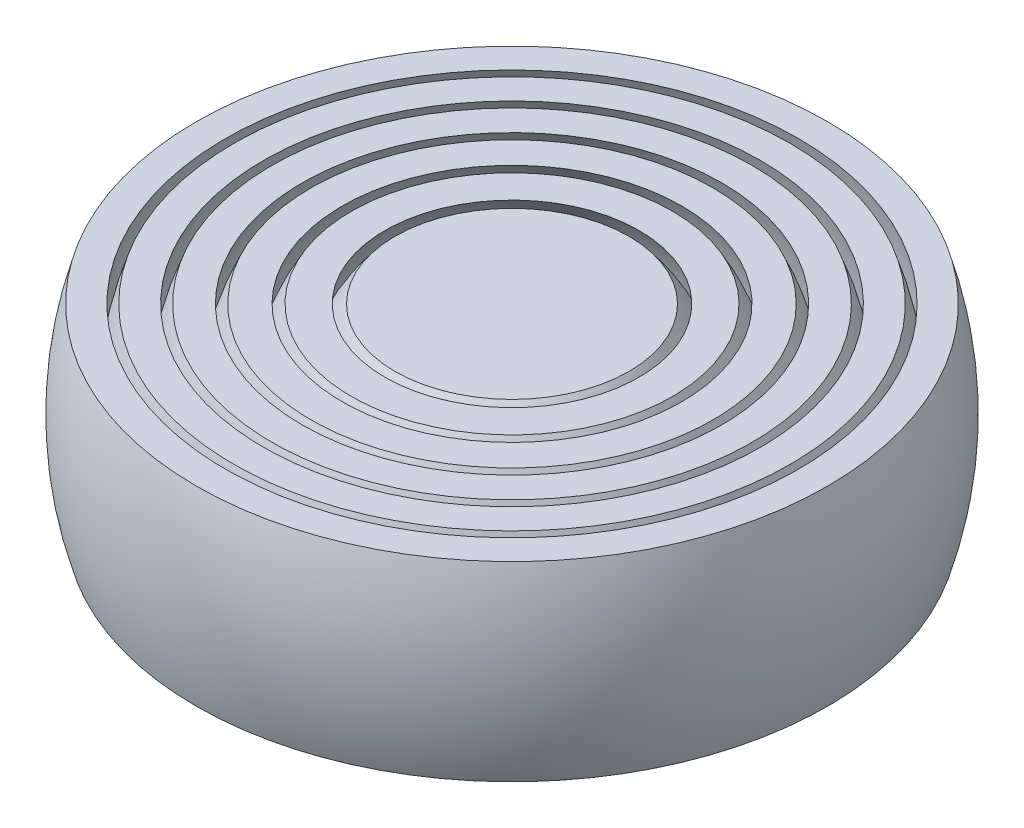
ISO-10303-21;
HEADER;
FILE_DESCRIPTION(('STEP AP214'),'2;1');
FILE_NAME('part.step','',(''),(''),'','','');
FILE_SCHEMA(('AUTOMOTIVE_DESIGN { 1 0 10303 214 1 1 1 1 }'));
ENDSEC;
DATA;
#1=APPLICATION_CONTEXT('core data for automotive mechanical design processes');
#2=APPLICATION_PROTOCOL_DEFINITION('international standard','automotive_design',2000,#1);
#3=PRODUCT_CONTEXT('',#1,'mechanical');
#4=PRODUCT('Part','Part','',(#3));
#5=PRODUCT_RELATED_PRODUCT_CATEGORY('part','',(#4));
#6=PRODUCT_DEFINITION_FORMATION('','',#4);
#7=PRODUCT_DEFINITION_CONTEXT('part definition',#1,'design');
#8=PRODUCT_DEFINITION('design','',#6,#7);
#9=PRODUCT_DEFINITION_SHAPE('','',#8);
#10=(LENGTH_UNIT() NAMED_UNIT(*) SI_UNIT(.MILLI.,.METRE.));
#11=(NAMED_UNIT(*) PLANE_ANGLE_UNIT() SI_UNIT($,.RADIAN.));
#12=(NAMED_UNIT(*) SI_UNIT($,.STERADIAN.) SOLID_ANGLE_UNIT());
#13=UNCERTAINTY_MEASURE_WITH_UNIT(LENGTH_MEASURE(1.E-05),#10,'distance_accuracy_value','');
#14=(GEOMETRIC_REPRESENTATION_CONTEXT(3) GLOBAL_UNCERTAINTY_ASSIGNED_CONTEXT((#13)) GLOBAL_UNIT_ASSIGNED_CONTEXT((#10,
#11,#12)) REPRESENTATION_CONTEXT('',''));
#15=CARTESIAN_POINT('',(0.,0.,0.));
#16=DIRECTION('',(0.,0.,1.));
#17=DIRECTION('',(1.,0.,0.));
#18=AXIS2_PLACEMENT_3D('',#15,#16,#17);
#19=CARTESIAN_POINT('',(0.,0.,0.));
#20=DIRECTION('',(0.,1.,0.));
#21=DIRECTION('',(1.,0.,0.));
#22=AXIS2_PLACEMENT_3D('',#19,#20,#21);
#23=SPHERICAL_SURFACE('',#22,19.);
#24=CARTESIAN_POINT('',(0.,6.,0.));
#25=DIRECTION('',(0.,-1.,0.));
#26=DIRECTION('',(0.,0.,-1.));
#27=AXIS2_PLACEMENT_3D('',#24,#25,#26);
#28=CIRCLE('',#27,18.0277563773199);
#29=CARTESIAN_POINT('',(0.,6.,-18.0277563773199));
#30=VERTEX_POINT('',#29);
#31=EDGE_CURVE('E46',#30,#30,#28,.F.);
#32=ORIENTED_EDGE('',*,*,#31,.T.);
#33=EDGE_LOOP('',(#32));
#34=FACE_BOUND('',#33,.T.);
#35=CARTESIAN_POINT('',(0.,-6.,0.));
#36=DIRECTION('',(0.,1.,0.));
#37=DIRECTION('',(0.,0.,1.));
#38=AXIS2_PLACEMENT_3D('',#35,#36,#37);
#39=CIRCLE('',#38,18.0277563773199);
#40=CARTESIAN_POINT('',(0.,-6.,18.0277563773199));
#41=VERTEX_POINT('',#40);
#42=EDGE_CURVE('E56',#41,#41,#39,.F.);
#43=ORIENTED_EDGE('',*,*,#42,.T.);
#44=EDGE_LOOP('',(#43));
#45=FACE_BOUND('',#44,.T.);
#46=ADVANCED_FACE('F42',(#34,#45),#23,.F.);
#47=CARTESIAN_POINT('',(-37.440696528812,-6.,-20.75));
#48=DIRECTION('',(0.,1.,0.));
#49=DIRECTION('',(0.,0.,1.));
#50=AXIS2_PLACEMENT_3D('',#47,#48,#49);
#51=PLANE('',#50);
#52=CARTESIAN_POINT('',(0.,-6.,0.));
#53=DIRECTION('',(0.,1.,0.));
#54=DIRECTION('',(0.,0.,1.));
#55=AXIS2_PLACEMENT_3D('',#52,#53,#54);
#56=CIRCLE('',#55,19.8635973579813);
#57=CARTESIAN_POINT('',(0.,-6.,19.8635973579813));
#58=VERTEX_POINT('',#57);
#59=EDGE_CURVE('E54',#58,#58,#56,.F.);
#60=ORIENTED_EDGE('',*,*,#59,.T.);
#61=EDGE_LOOP('',(#60));
#62=FACE_BOUND('',#61,.T.);
#63=ORIENTED_EDGE('',*,*,#42,.F.);
#64=EDGE_LOOP('',(#63));
#65=FACE_BOUND('',#64,.T.);
#66=ADVANCED_FACE('F63',(#62,#65),#51,.F.);
#67=CARTESIAN_POINT('',(-37.440696528812,6.,-20.75));
#68=DIRECTION('',(0.,-1.,0.));
#69=DIRECTION('',(0.,0.,-1.));
#70=AXIS2_PLACEMENT_3D('',#67,#68,#69);
#71=PLANE('',#70);
#72=CARTESIAN_POINT('',(0.,6.,0.));
#73=DIRECTION('',(0.,-1.,0.));
#74=DIRECTION('',(0.,0.,-1.));
#75=AXIS2_PLACEMENT_3D('',#72,#73,#74);
#76=CIRCLE('',#75,19.8635973579813);
#77=CARTESIAN_POINT('',(0.,6.,-19.8635973579813));
#78=VERTEX_POINT('',#77);
#79=EDGE_CURVE('E11',#78,#78,#76,.F.);
#80=ORIENTED_EDGE('',*,*,#79,.T.);
#81=EDGE_LOOP('',(#80));
#82=FACE_BOUND('',#81,.T.);
#83=ORIENTED_EDGE('',*,*,#31,.F.);
#84=EDGE_LOOP('',(#83));
#85=FACE_BOUND('',#84,.T.);
#86=ADVANCED_FACE('F67',(#82,#85),#71,.F.);
#87=CARTESIAN_POINT('',(0.,0.,0.));
#88=DIRECTION('',(0.,1.,0.));
#89=DIRECTION('',(-1.,0.,0.));
#90=AXIS2_PLACEMENT_3D('',#87,#88,#89);
#91=SPHERICAL_SURFACE('',#90,20.75);
#92=ORIENTED_EDGE('',*,*,#79,.F.);
#93=EDGE_LOOP('',(#92));
#94=FACE_BOUND('',#93,.T.);
#95=ORIENTED_EDGE('',*,*,#59,.F.);
#96=EDGE_LOOP('',(#95));
#97=FACE_BOUND('',#96,.T.);
#98=ADVANCED_FACE('F44',(#94,#97),#91,.T.);
#99=CLOSED_SHELL('',(#46,#66,#86,#98));
#100=MANIFOLD_SOLID_BREP('B2',#99);
#101=CARTESIAN_POINT('',(0.,0.,0.));
#102=DIRECTION('',(0.,1.,0.));
#103=DIRECTION('',(1.,0.,0.));
#104=AXIS2_PLACEMENT_3D('',#101,#102,#103);
#105=SPHERICAL_SURFACE('',#104,16.75);
#106=CARTESIAN_POINT('',(0.,6.,0.));
#107=DIRECTION('',(0.,-1.,0.));
#108=DIRECTION('',(0.,0.,-1.));
#109=AXIS2_PLACEMENT_3D('',#106,#107,#108);
#110=CIRCLE('',#109,15.6384941730334);
#111=CARTESIAN_POINT('',(0.,6.,-15.6384941730334));
#112=VERTEX_POINT('',#111);
#113=EDGE_CURVE('E116',#112,#112,#110,.F.);
#114=ORIENTED_EDGE('',*,*,#113,.T.);
#115=EDGE_LOOP('',(#114));
#116=FACE_BOUND('',#115,.T.);
#117=CARTESIAN_POINT('',(0.,-6.,0.));
#118=DIRECTION('',(0.,1.,0.));
#119=DIRECTION('',(0.,0.,1.));
#120=AXIS2_PLACEMENT_3D('',#117,#118,#119);
#121=CIRCLE('',#120,15.6384941730334);
#122=CARTESIAN_POINT('',(0.,-6.,15.6384941730334));
#123=VERTEX_POINT('',#122);
#124=EDGE_CURVE('E126',#123,#123,#121,.F.);
#125=ORIENTED_EDGE('',*,*,#124,.T.);
#126=EDGE_LOOP('',(#125));
#127=FACE_BOUND('',#126,.T.);
#128=ADVANCED_FACE('F112',(#116,#127),#105,.F.);
#129=CARTESIAN_POINT('',(-37.440696528812,-6.,-20.75));
#130=DIRECTION('',(0.,1.,0.));
#131=DIRECTION('',(0.,0.,1.));
#132=AXIS2_PLACEMENT_3D('',#129,#130,#131);
#133=PLANE('',#132);
#134=CARTESIAN_POINT('',(0.,-6.,0.));
#135=DIRECTION('',(0.,1.,0.));
#136=DIRECTION('',(0.,0.,1.));
#137=AXIS2_PLACEMENT_3D('',#134,#135,#136);
#138=CIRCLE('',#137,17.5);
#139=CARTESIAN_POINT('',(0.,-6.,17.5));
#140=VERTEX_POINT('',#139);
#141=EDGE_CURVE('E124',#140,#140,#138,.F.);
#142=ORIENTED_EDGE('',*,*,#141,.T.);
#143=EDGE_LOOP('',(#142));
#144=FACE_BOUND('',#143,.T.);
#145=ORIENTED_EDGE('',*,*,#124,.F.);
#146=EDGE_LOOP('',(#145));
#147=FACE_BOUND('',#146,.T.);
#148=ADVANCED_FACE('F133',(#144,#147),#133,.F.);
#149=CARTESIAN_POINT('',(-37.440696528812,6.,-20.75));
#150=DIRECTION('',(0.,-1.,0.));
#151=DIRECTION('',(0.,0.,-1.));
#152=AXIS2_PLACEMENT_3D('',#149,#150,#151);
#153=PLANE('',#152);
#154=CARTESIAN_POINT('',(0.,6.,0.));
#155=DIRECTION('',(0.,-1.,0.));
#156=DIRECTION('',(0.,0.,-1.));
#157=AXIS2_PLACEMENT_3D('',#154,#155,#156);
#158=CIRCLE('',#157,17.5);
#159=CARTESIAN_POINT('',(0.,6.,-17.5));
#160=VERTEX_POINT('',#159);
#161=EDGE_CURVE('E41',#160,#160,#158,.F.);
#162=ORIENTED_EDGE('',*,*,#161,.T.);
#163=EDGE_LOOP('',(#162));
#164=FACE_BOUND('',#163,.T.);
#165=ORIENTED_EDGE('',*,*,#113,.F.);
#166=EDGE_LOOP('',(#165));
#167=FACE_BOUND('',#166,.T.);
#168=ADVANCED_FACE('F137',(#164,#167),#153,.F.);
#169=CARTESIAN_POINT('',(0.,0.,0.));
#170=DIRECTION('',(0.,1.,0.));
#171=DIRECTION('',(1.,0.,0.));
#172=AXIS2_PLACEMENT_3D('',#169,#170,#171);
#173=SPHERICAL_SURFACE('',#172,18.5);
#174=ORIENTED_EDGE('',*,*,#161,.F.);
#175=EDGE_LOOP('',(#174));
#176=FACE_BOUND('',#175,.T.);
#177=ORIENTED_EDGE('',*,*,#141,.F.);
#178=EDGE_LOOP('',(#177));
#179=FACE_BOUND('',#178,.T.);
#180=ADVANCED_FACE('F114',(#176,#179),#173,.T.);
#181=CLOSED_SHELL('',(#128,#148,#168,#180));
#182=MANIFOLD_SOLID_BREP('B6',#181);
#183=CARTESIAN_POINT('',(0.,0.,0.));
#184=DIRECTION('',(0.,1.,0.));
#185=DIRECTION('',(1.,0.,0.));
#186=AXIS2_PLACEMENT_3D('',#183,#184,#185);
#187=SPHERICAL_SURFACE('',#186,14.5);
#188=CARTESIAN_POINT('',(0.,6.,0.));
#189=DIRECTION('',(0.,-1.,0.));
#190=DIRECTION('',(0.,0.,-1.));
#191=AXIS2_PLACEMENT_3D('',#188,#189,#190);
#192=CIRCLE('',#191,13.2003787824441);
#193=CARTESIAN_POINT('',(0.,6.,-13.2003787824441));
#194=VERTEX_POINT('',#193);
#195=EDGE_CURVE('E186',#194,#194,#192,.F.);
#196=ORIENTED_EDGE('',*,*,#195,.T.);
#197=EDGE_LOOP('',(#196));
#198=FACE_BOUND('',#197,.T.);
#199=CARTESIAN_POINT('',(0.,-6.,0.));
#200=DIRECTION('',(0.,1.,0.));
#201=DIRECTION('',(0.,0.,1.));
#202=AXIS2_PLACEMENT_3D('',#199,#200,#201);
#203=CIRCLE('',#202,13.2003787824441);
#204=CARTESIAN_POINT('',(0.,-6.,13.2003787824441));
#205=VERTEX_POINT('',#204);
#206=EDGE_CURVE('E196',#205,#205,#203,.F.);
#207=ORIENTED_EDGE('',*,*,#206,.T.);
#208=EDGE_LOOP('',(#207));
#209=FACE_BOUND('',#208,.T.);
#210=ADVANCED_FACE('F182',(#198,#209),#187,.F.);
#211=CARTESIAN_POINT('',(-37.440696528812,-6.,-20.75));
#212=DIRECTION('',(0.,1.,0.));
#213=DIRECTION('',(0.,0.,1.));
#214=AXIS2_PLACEMENT_3D('',#211,#212,#213);
#215=PLANE('',#214);
#216=CARTESIAN_POINT('',(0.,-6.,0.));
#217=DIRECTION('',(0.,1.,0.));
#218=DIRECTION('',(0.,0.,1.));
#219=AXIS2_PLACEMENT_3D('',#216,#217,#218);
#220=CIRCLE('',#219,15.101738310539);
#221=CARTESIAN_POINT('',(0.,-6.,15.101738310539));
#222=VERTEX_POINT('',#221);
#223=EDGE_CURVE('E194',#222,#222,#220,.F.);
#224=ORIENTED_EDGE('',*,*,#223,.T.);
#225=EDGE_LOOP('',(#224));
#226=FACE_BOUND('',#225,.T.);
#227=ORIENTED_EDGE('',*,*,#206,.F.);
#228=EDGE_LOOP('',(#227));
#229=FACE_BOUND('',#228,.T.);
#230=ADVANCED_FACE('F203',(#226,#229),#215,.F.);
#231=CARTESIAN_POINT('',(-37.440696528812,6.,-20.75));
#232=DIRECTION('',(0.,-1.,0.));
#233=DIRECTION('',(0.,0.,-1.));
#234=AXIS2_PLACEMENT_3D('',#231,#232,#233);
#235=PLANE('',#234);
#236=CARTESIAN_POINT('',(0.,6.,0.));
#237=DIRECTION('',(0.,-1.,0.));
#238=DIRECTION('',(0.,0.,-1.));
#239=AXIS2_PLACEMENT_3D('',#236,#237,#238);
#240=CIRCLE('',#239,15.101738310539);
#241=CARTESIAN_POINT('',(0.,6.,-15.101738310539));
#242=VERTEX_POINT('',#241);
#243=EDGE_CURVE('E111',#242,#242,#240,.F.);
#244=ORIENTED_EDGE('',*,*,#243,.T.);
#245=EDGE_LOOP('',(#244));
#246=FACE_BOUND('',#245,.T.);
#247=ORIENTED_EDGE('',*,*,#195,.F.);
#248=EDGE_LOOP('',(#247));
#249=FACE_BOUND('',#248,.T.);
#250=ADVANCED_FACE('F207',(#246,#249),#235,.F.);
#251=CARTESIAN_POINT('',(0.,0.,0.));
#252=DIRECTION('',(0.,1.,0.));
#253=DIRECTION('',(1.,0.,0.));
#254=AXIS2_PLACEMENT_3D('',#251,#252,#253);
#255=SPHERICAL_SURFACE('',#254,16.25);
#256=ORIENTED_EDGE('',*,*,#243,.F.);
#257=EDGE_LOOP('',(#256));
#258=FACE_BOUND('',#257,.T.);
#259=ORIENTED_EDGE('',*,*,#223,.F.);
#260=EDGE_LOOP('',(#259));
#261=FACE_BOUND('',#260,.T.);
#262=ADVANCED_FACE('F184',(#258,#261),#255,.T.);
#263=CLOSED_SHELL('',(#210,#230,#250,#262));
#264=MANIFOLD_SOLID_BREP('B36',#263);
#265=CARTESIAN_POINT('',(0.,0.,0.));
#266=DIRECTION('',(0.,1.,0.));
#267=DIRECTION('',(1.,0.,0.));
#268=AXIS2_PLACEMENT_3D('',#265,#266,#267);
#269=SPHERICAL_SURFACE('',#268,12.25);
#270=CARTESIAN_POINT('',(0.,6.,0.));
#271=DIRECTION('',(0.,-1.,0.));
#272=DIRECTION('',(0.,0.,-1.));
#273=AXIS2_PLACEMENT_3D('',#270,#271,#272);
#274=CIRCLE('',#273,10.6800046816469);
#275=CARTESIAN_POINT('',(0.,6.,-10.6800046816469));
#276=VERTEX_POINT('',#275);
#277=EDGE_CURVE('E256',#276,#276,#274,.F.);
#278=ORIENTED_EDGE('',*,*,#277,.T.);
#279=EDGE_LOOP('',(#278));
#280=FACE_BOUND('',#279,.T.);
#281=CARTESIAN_POINT('',(0.,-6.,0.));
#282=DIRECTION('',(0.,1.,0.));
#283=DIRECTION('',(0.,0.,1.));
#284=AXIS2_PLACEMENT_3D('',#281,#282,#283);
#285=CIRCLE('',#284,10.6800046816469);
#286=CARTESIAN_POINT('',(0.,-6.,10.6800046816469));
#287=VERTEX_POINT('',#286);
#288=EDGE_CURVE('E266',#287,#287,#285,.F.);
#289=ORIENTED_EDGE('',*,*,#288,.T.);
#290=EDGE_LOOP('',(#289));
#291=FACE_BOUND('',#290,.T.);
#292=ADVANCED_FACE('F252',(#280,#291),#269,.F.);
#293=CARTESIAN_POINT('',(-37.440696528812,-6.,-20.75));
#294=DIRECTION('',(0.,1.,0.));
#295=DIRECTION('',(0.,0.,1.));
#296=AXIS2_PLACEMENT_3D('',#293,#294,#295);
#297=PLANE('',#296);
#298=CARTESIAN_POINT('',(0.,-6.,0.));
#299=DIRECTION('',(0.,1.,0.));
#300=DIRECTION('',(0.,0.,1.));
#301=AXIS2_PLACEMENT_3D('',#298,#299,#300);
#302=CIRCLE('',#301,12.6491106406735);
#303=CARTESIAN_POINT('',(0.,-6.,12.6491106406735));
#304=VERTEX_POINT('',#303);
#305=EDGE_CURVE('E264',#304,#304,#302,.F.);
#306=ORIENTED_EDGE('',*,*,#305,.T.);
#307=EDGE_LOOP('',(#306));
#308=FACE_BOUND('',#307,.T.);
#309=ORIENTED_EDGE('',*,*,#288,.F.);
#310=EDGE_LOOP('',(#309));
#311=FACE_BOUND('',#310,.T.);
#312=ADVANCED_FACE('F273',(#308,#311),#297,.F.);
#313=CARTESIAN_POINT('',(-37.440696528812,6.,-20.75));
#314=DIRECTION('',(0.,-1.,0.));
#315=DIRECTION('',(0.,0.,-1.));
#316=AXIS2_PLACEMENT_3D('',#313,#314,#315);
#317=PLANE('',#316);
#318=CARTESIAN_POINT('',(0.,6.,0.));
#319=DIRECTION('',(0.,-1.,0.));
#320=DIRECTION('',(0.,0.,-1.));
#321=AXIS2_PLACEMENT_3D('',#318,#319,#320);
#322=CIRCLE('',#321,12.6491106406735);
#323=CARTESIAN_POINT('',(0.,6.,-12.6491106406735));
#324=VERTEX_POINT('',#323);
#325=EDGE_CURVE('E181',#324,#324,#322,.F.);
#326=ORIENTED_EDGE('',*,*,#325,.T.);
#327=EDGE_LOOP('',(#326));
#328=FACE_BOUND('',#327,.T.);
#329=ORIENTED_EDGE('',*,*,#277,.F.);
#330=EDGE_LOOP('',(#329));
#331=FACE_BOUND('',#330,.T.);
#332=ADVANCED_FACE('F277',(#328,#331),#317,.F.);
#333=CARTESIAN_POINT('',(0.,0.,0.));
#334=DIRECTION('',(0.,1.,0.));
#335=DIRECTION('',(1.,0.,0.));
#336=AXIS2_PLACEMENT_3D('',#333,#334,#335);
#337=SPHERICAL_SURFACE('',#336,14.);
#338=ORIENTED_EDGE('',*,*,#325,.F.);
#339=EDGE_LOOP('',(#338));
#340=FACE_BOUND('',#339,.T.);
#341=ORIENTED_EDGE('',*,*,#305,.F.);
#342=EDGE_LOOP('',(#341));
#343=FACE_BOUND('',#342,.T.);
#344=ADVANCED_FACE('F254',(#340,#343),#337,.T.);
#345=CLOSED_SHELL('',(#292,#312,#332,#344));
#346=MANIFOLD_SOLID_BREP('B106',#345);
#347=CARTESIAN_POINT('',(0.,0.,0.));
#348=DIRECTION('',(0.,1.,0.));
#349=DIRECTION('',(1.,0.,0.));
#350=AXIS2_PLACEMENT_3D('',#347,#348,#349);
#351=SPHERICAL_SURFACE('',#350,10.);
#352=CARTESIAN_POINT('',(0.,6.,0.));
#353=DIRECTION('',(0.,-1.,0.));
#354=DIRECTION('',(0.,0.,-1.));
#355=AXIS2_PLACEMENT_3D('',#352,#353,#354);
#356=CIRCLE('',#355,8.);
#357=CARTESIAN_POINT('',(0.,6.,-8.));
#358=VERTEX_POINT('',#357);
#359=EDGE_CURVE('E325',#358,#358,#356,.F.);
#360=ORIENTED_EDGE('',*,*,#359,.T.);
#361=EDGE_LOOP('',(#360));
#362=FACE_BOUND('',#361,.T.);
#363=CARTESIAN_POINT('',(0.,-6.,0.));
#364=DIRECTION('',(0.,1.,0.));
#365=DIRECTION('',(0.,0.,1.));
#366=AXIS2_PLACEMENT_3D('',#363,#364,#365);
#367=CIRCLE('',#366,8.);
#368=CARTESIAN_POINT('',(0.,-6.,8.));
#369=VERTEX_POINT('',#368);
#370=EDGE_CURVE('E335',#369,#369,#367,.F.);
#371=ORIENTED_EDGE('',*,*,#370,.T.);
#372=EDGE_LOOP('',(#371));
#373=FACE_BOUND('',#372,.T.);
#374=ADVANCED_FACE('F321',(#362,#373),#351,.F.);
#375=CARTESIAN_POINT('',(-37.440696528812,-6.,-20.75));
#376=DIRECTION('',(0.,1.,0.));
#377=DIRECTION('',(0.,0.,1.));
#378=AXIS2_PLACEMENT_3D('',#375,#376,#377);
#379=PLANE('',#378);
#380=CARTESIAN_POINT('',(0.,-6.,0.));
#381=DIRECTION('',(0.,1.,0.));
#382=DIRECTION('',(0.,0.,1.));
#383=AXIS2_PLACEMENT_3D('',#380,#381,#382);
#384=CIRCLE('',#383,10.1025986755884);
#385=CARTESIAN_POINT('',(0.,-6.,10.1025986755884));
#386=VERTEX_POINT('',#385);
#387=EDGE_CURVE('E333',#386,#386,#384,.F.);
#388=ORIENTED_EDGE('',*,*,#387,.T.);
#389=EDGE_LOOP('',(#388));
#390=FACE_BOUND('',#389,.T.);
#391=ORIENTED_EDGE('',*,*,#370,.F.);
#392=EDGE_LOOP('',(#391));
#393=FACE_BOUND('',#392,.T.);
#394=ADVANCED_FACE('F342',(#390,#393),#379,.F.);
#395=CARTESIAN_POINT('',(-37.440696528812,6.,-20.75));
#396=DIRECTION('',(0.,-1.,0.));
#397=DIRECTION('',(0.,0.,-1.));
#398=AXIS2_PLACEMENT_3D('',#395,#396,#397);
#399=PLANE('',#398);
#400=CARTESIAN_POINT('',(0.,6.,0.));
#401=DIRECTION('',(0.,-1.,0.));
#402=DIRECTION('',(0.,0.,-1.));
#403=AXIS2_PLACEMENT_3D('',#400,#401,#402);
#404=CIRCLE('',#403,10.1025986755884);
#405=CARTESIAN_POINT('',(0.,6.,-10.1025986755884));
#406=VERTEX_POINT('',#405);
#407=EDGE_CURVE('E251',#406,#406,#404,.F.);
#408=ORIENTED_EDGE('',*,*,#407,.T.);
#409=EDGE_LOOP('',(#408));
#410=FACE_BOUND('',#409,.T.);
#411=ORIENTED_EDGE('',*,*,#359,.F.);
#412=EDGE_LOOP('',(#411));
#413=FACE_BOUND('',#412,.T.);
#414=ADVANCED_FACE('F346',(#410,#413),#399,.F.);
#415=CARTESIAN_POINT('',(0.,0.,0.));
#416=DIRECTION('',(0.,1.,0.));
#417=DIRECTION('',(1.,0.,0.));
#418=AXIS2_PLACEMENT_3D('',#415,#416,#417);
#419=SPHERICAL_SURFACE('',#418,11.75);
#420=ORIENTED_EDGE('',*,*,#407,.F.);
#421=EDGE_LOOP('',(#420));
#422=FACE_BOUND('',#421,.T.);
#423=ORIENTED_EDGE('',*,*,#387,.F.);
#424=EDGE_LOOP('',(#423));
#425=FACE_BOUND('',#424,.T.);
#426=ADVANCED_FACE('F323',(#422,#425),#419,.T.);
#427=CLOSED_SHELL('',(#374,#394,#414,#426));
#428=MANIFOLD_SOLID_BREP('B176',#427);
#429=CARTESIAN_POINT('',(0.,0.,0.));
#430=DIRECTION('',(0.,1.,0.));
#431=DIRECTION('',(1.,0.,0.));
#432=AXIS2_PLACEMENT_3D('',#429,#430,#431);
#433=SPHERICAL_SURFACE('',#432,9.5);
#434=CARTESIAN_POINT('',(0.,6.,0.));
#435=DIRECTION('',(0.,-1.,0.));
#436=DIRECTION('',(0.,0.,-1.));
#437=AXIS2_PLACEMENT_3D('',#434,#435,#436);
#438=CIRCLE('',#437,7.36545993132812);
#439=CARTESIAN_POINT('',(0.,6.,-7.36545993132812));
#440=VERTEX_POINT('',#439);
#441=EDGE_CURVE('E320',#440,#440,#438,.F.);
#442=ORIENTED_EDGE('',*,*,#441,.F.);
#443=EDGE_LOOP('',(#442));
#444=FACE_BOUND('',#443,.T.);
#445=CARTESIAN_POINT('',(0.,-6.,0.));
#446=DIRECTION('',(0.,1.,0.));
#447=DIRECTION('',(0.,0.,1.));
#448=AXIS2_PLACEMENT_3D('',#445,#446,#447);
#449=CIRCLE('',#448,7.36545993132812);
#450=CARTESIAN_POINT('',(0.,-6.,7.36545993132812));
#451=VERTEX_POINT('',#450);
#452=EDGE_CURVE('E389',#451,#451,#449,.F.);
#453=ORIENTED_EDGE('',*,*,#452,.F.);
#454=EDGE_LOOP('',(#453));
#455=FACE_BOUND('',#454,.T.);
#456=ADVANCED_FACE('F383',(#444,#455),#433,.T.);
#457=CARTESIAN_POINT('',(-37.440696528812,-6.,-20.75));
#458=DIRECTION('',(0.,1.,0.));
#459=DIRECTION('',(0.,0.,1.));
#460=AXIS2_PLACEMENT_3D('',#457,#458,#459);
#461=PLANE('',#460);
#462=ORIENTED_EDGE('',*,*,#452,.T.);
#463=EDGE_LOOP('',(#462));
#464=FACE_BOUND('',#463,.T.);
#465=ADVANCED_FACE('F395',(#464),#461,.F.);
#466=CARTESIAN_POINT('',(-37.440696528812,6.,-20.75));
#467=DIRECTION('',(0.,-1.,0.));
#468=DIRECTION('',(0.,0.,-1.));
#469=AXIS2_PLACEMENT_3D('',#466,#467,#468);
#470=PLANE('',#469);
#471=ORIENTED_EDGE('',*,*,#441,.T.);
#472=EDGE_LOOP('',(#471));
#473=FACE_BOUND('',#472,.T.);
#474=ADVANCED_FACE('F402',(#473),#470,.F.);
#475=CLOSED_SHELL('',(#456,#465,#474));
#476=MANIFOLD_SOLID_BREP('B246',#475);
#477=ADVANCED_BREP_SHAPE_REPRESENTATION('',(#18,#100,#182,#264,#346,#428,#476),#14);
#478=SHAPE_DEFINITION_REPRESENTATION(#9,#477);
ENDSEC;
END-ISO-10303-21;
